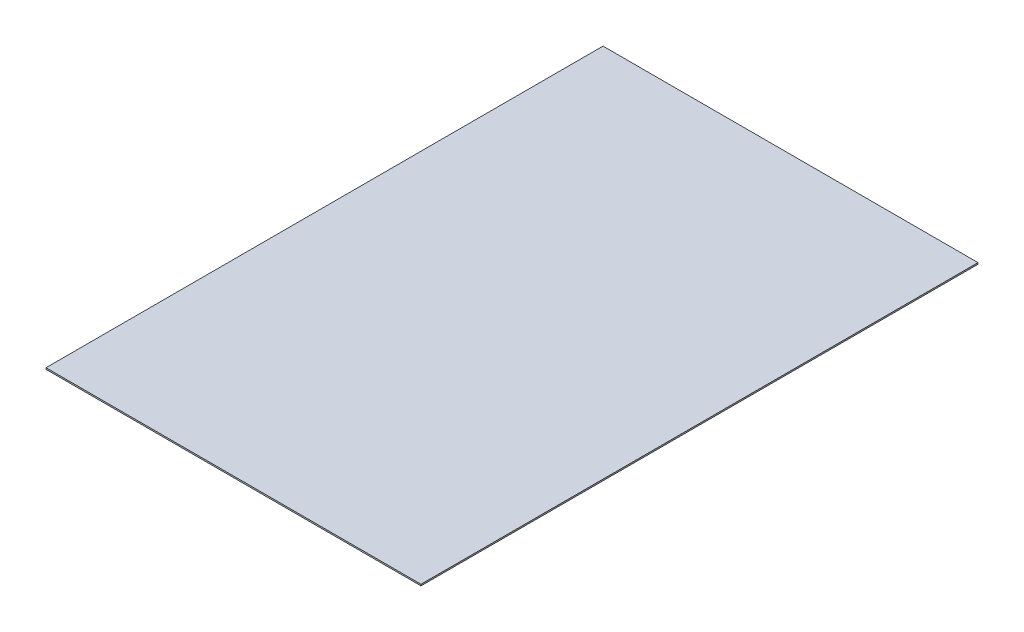
ISO-10303-21;
HEADER;
FILE_DESCRIPTION(('STEP AP214'),'2;1');
FILE_NAME('part.step','',(''),(''),'','','');
FILE_SCHEMA(('AUTOMOTIVE_DESIGN { 1 0 10303 214 1 1 1 1 }'));
ENDSEC;
DATA;
#1=APPLICATION_CONTEXT('core data for automotive mechanical design processes');
#2=APPLICATION_PROTOCOL_DEFINITION('international standard','automotive_design',2000,#1);
#3=PRODUCT_CONTEXT('',#1,'mechanical');
#4=PRODUCT('Part','Part','',(#3));
#5=PRODUCT_RELATED_PRODUCT_CATEGORY('part','',(#4));
#6=PRODUCT_DEFINITION_FORMATION('','',#4);
#7=PRODUCT_DEFINITION_CONTEXT('part definition',#1,'design');
#8=PRODUCT_DEFINITION('design','',#6,#7);
#9=PRODUCT_DEFINITION_SHAPE('','',#8);
#10=(LENGTH_UNIT() NAMED_UNIT(*) SI_UNIT(.MILLI.,.METRE.));
#11=(NAMED_UNIT(*) PLANE_ANGLE_UNIT() SI_UNIT($,.RADIAN.));
#12=(NAMED_UNIT(*) SI_UNIT($,.STERADIAN.) SOLID_ANGLE_UNIT());
#13=UNCERTAINTY_MEASURE_WITH_UNIT(LENGTH_MEASURE(1.E-05),#10,'distance_accuracy_value','');
#14=(GEOMETRIC_REPRESENTATION_CONTEXT(3) GLOBAL_UNCERTAINTY_ASSIGNED_CONTEXT((#13)) GLOBAL_UNIT_ASSIGNED_CONTEXT((#10,
#11,#12)) REPRESENTATION_CONTEXT('',''));
#15=CARTESIAN_POINT('',(0.,0.,0.));
#16=DIRECTION('',(0.,0.,1.));
#17=DIRECTION('',(1.,0.,0.));
#18=AXIS2_PLACEMENT_3D('',#15,#16,#17);
#19=CARTESIAN_POINT('',(-257.5,2.,382.5));
#20=DIRECTION('',(1.,0.,0.));
#21=DIRECTION('',(0.,0.,-1.));
#22=AXIS2_PLACEMENT_3D('',#19,#20,#21);
#23=PLANE('',#22);
#24=DIRECTION('',(0.,0.,1.));
#25=VECTOR('',#24,1.);
#26=CARTESIAN_POINT('',(-257.5,0.,382.5));
#27=LINE('',#26,#25);
#28=CARTESIAN_POINT('',(-257.5,0.,-382.5));
#29=VERTEX_POINT('',#28);
#30=CARTESIAN_POINT('',(-257.5,0.,382.5));
#31=VERTEX_POINT('',#30);
#32=EDGE_CURVE('E101',#29,#31,#27,.T.);
#33=ORIENTED_EDGE('',*,*,#32,.T.);
#34=DIRECTION('',(0.,-1.,0.));
#35=VECTOR('',#34,1.);
#36=CARTESIAN_POINT('',(-257.5,2.,382.5));
#37=LINE('',#36,#35);
#38=CARTESIAN_POINT('',(-257.5,2.,382.5));
#39=VERTEX_POINT('',#38);
#40=EDGE_CURVE('E11',#39,#31,#37,.T.);
#41=ORIENTED_EDGE('',*,*,#40,.F.);
#42=DIRECTION('',(0.,0.,1.));
#43=VECTOR('',#42,1.);
#44=CARTESIAN_POINT('',(-257.5,2.,382.5));
#45=LINE('',#44,#43);
#46=CARTESIAN_POINT('',(-257.5,2.,-382.5));
#47=VERTEX_POINT('',#46);
#48=EDGE_CURVE('E89',#47,#39,#45,.T.);
#49=ORIENTED_EDGE('',*,*,#48,.F.);
#50=DIRECTION('',(0.,-1.,0.));
#51=VECTOR('',#50,1.);
#52=CARTESIAN_POINT('',(-257.5,2.,-382.5));
#53=LINE('',#52,#51);
#54=EDGE_CURVE('E97',#47,#29,#53,.T.);
#55=ORIENTED_EDGE('',*,*,#54,.T.);
#56=EDGE_LOOP('',(#33,#41,#49,#55));
#57=FACE_BOUND('',#56,.T.);
#58=ADVANCED_FACE('F38',(#57),#23,.F.);
#59=CARTESIAN_POINT('',(257.5,2.,382.5));
#60=DIRECTION('',(0.,0.,-1.));
#61=DIRECTION('',(-1.,0.,0.));
#62=AXIS2_PLACEMENT_3D('',#59,#60,#61);
#63=PLANE('',#62);
#64=DIRECTION('',(1.,0.,0.));
#65=VECTOR('',#64,1.);
#66=CARTESIAN_POINT('',(257.5,0.,382.5));
#67=LINE('',#66,#65);
#68=CARTESIAN_POINT('',(257.5,0.,382.5));
#69=VERTEX_POINT('',#68);
#70=EDGE_CURVE('E93',#31,#69,#67,.T.);
#71=ORIENTED_EDGE('',*,*,#70,.T.);
#72=DIRECTION('',(0.,-1.,0.));
#73=VECTOR('',#72,1.);
#74=CARTESIAN_POINT('',(257.5,2.,382.5));
#75=LINE('',#74,#73);
#76=CARTESIAN_POINT('',(257.5,2.,382.5));
#77=VERTEX_POINT('',#76);
#78=EDGE_CURVE('E46',#77,#69,#75,.T.);
#79=ORIENTED_EDGE('',*,*,#78,.F.);
#80=DIRECTION('',(1.,0.,0.));
#81=VECTOR('',#80,1.);
#82=CARTESIAN_POINT('',(257.5,2.,382.5));
#83=LINE('',#82,#81);
#84=EDGE_CURVE('E84',#39,#77,#83,.T.);
#85=ORIENTED_EDGE('',*,*,#84,.F.);
#86=ORIENTED_EDGE('',*,*,#40,.T.);
#87=EDGE_LOOP('',(#71,#79,#85,#86));
#88=FACE_BOUND('',#87,.T.);
#89=ADVANCED_FACE('F92',(#88),#63,.F.);
#90=CARTESIAN_POINT('',(257.5,2.,382.5));
#91=DIRECTION('',(-1.,0.,0.));
#92=DIRECTION('',(0.,0.,1.));
#93=AXIS2_PLACEMENT_3D('',#90,#91,#92);
#94=PLANE('',#93);
#95=DIRECTION('',(0.,0.,-1.));
#96=VECTOR('',#95,1.);
#97=CARTESIAN_POINT('',(257.5,0.,382.5));
#98=LINE('',#97,#96);
#99=CARTESIAN_POINT('',(257.5,0.,-382.5));
#100=VERTEX_POINT('',#99);
#101=EDGE_CURVE('E71',#69,#100,#98,.T.);
#102=ORIENTED_EDGE('',*,*,#101,.T.);
#103=DIRECTION('',(0.,-1.,0.));
#104=VECTOR('',#103,1.);
#105=CARTESIAN_POINT('',(257.5,2.,-382.5));
#106=LINE('',#105,#104);
#107=CARTESIAN_POINT('',(257.5,2.,-382.5));
#108=VERTEX_POINT('',#107);
#109=EDGE_CURVE('E94',#108,#100,#106,.T.);
#110=ORIENTED_EDGE('',*,*,#109,.F.);
#111=DIRECTION('',(0.,0.,-1.));
#112=VECTOR('',#111,1.);
#113=CARTESIAN_POINT('',(257.5,2.,382.5));
#114=LINE('',#113,#112);
#115=EDGE_CURVE('E87',#77,#108,#114,.T.);
#116=ORIENTED_EDGE('',*,*,#115,.F.);
#117=ORIENTED_EDGE('',*,*,#78,.T.);
#118=EDGE_LOOP('',(#102,#110,#116,#117));
#119=FACE_BOUND('',#118,.T.);
#120=ADVANCED_FACE('F95',(#119),#94,.F.);
#121=CARTESIAN_POINT('',(257.5,2.,-382.5));
#122=DIRECTION('',(0.,0.,1.));
#123=DIRECTION('',(1.,0.,0.));
#124=AXIS2_PLACEMENT_3D('',#121,#122,#123);
#125=PLANE('',#124);
#126=DIRECTION('',(-1.,0.,0.));
#127=VECTOR('',#126,1.);
#128=CARTESIAN_POINT('',(257.5,0.,-382.5));
#129=LINE('',#128,#127);
#130=EDGE_CURVE('E77',#100,#29,#129,.T.);
#131=ORIENTED_EDGE('',*,*,#130,.T.);
#132=ORIENTED_EDGE('',*,*,#54,.F.);
#133=DIRECTION('',(-1.,0.,0.));
#134=VECTOR('',#133,1.);
#135=CARTESIAN_POINT('',(257.5,2.,-382.5));
#136=LINE('',#135,#134);
#137=EDGE_CURVE('E54',#108,#47,#136,.T.);
#138=ORIENTED_EDGE('',*,*,#137,.F.);
#139=ORIENTED_EDGE('',*,*,#109,.T.);
#140=EDGE_LOOP('',(#131,#132,#138,#139));
#141=FACE_BOUND('',#140,.T.);
#142=ADVANCED_FACE('F108',(#141),#125,.F.);
#143=CARTESIAN_POINT('',(0.,2.,0.));
#144=DIRECTION('',(0.,1.,0.));
#145=DIRECTION('',(0.,0.,1.));
#146=AXIS2_PLACEMENT_3D('',#143,#144,#145);
#147=PLANE('',#146);
#148=ORIENTED_EDGE('',*,*,#48,.T.);
#149=ORIENTED_EDGE('',*,*,#84,.T.);
#150=ORIENTED_EDGE('',*,*,#115,.T.);
#151=ORIENTED_EDGE('',*,*,#137,.T.);
#152=EDGE_LOOP('',(#148,#149,#150,#151));
#153=FACE_BOUND('',#152,.T.);
#154=ADVANCED_FACE('F85',(#153),#147,.T.);
#155=CARTESIAN_POINT('',(0.,0.,0.));
#156=DIRECTION('',(0.,1.,0.));
#157=DIRECTION('',(0.,0.,1.));
#158=AXIS2_PLACEMENT_3D('',#155,#156,#157);
#159=PLANE('',#158);
#160=ORIENTED_EDGE('',*,*,#32,.F.);
#161=ORIENTED_EDGE('',*,*,#130,.F.);
#162=ORIENTED_EDGE('',*,*,#101,.F.);
#163=ORIENTED_EDGE('',*,*,#70,.F.);
#164=EDGE_LOOP('',(#160,#161,#162,#163));
#165=FACE_BOUND('',#164,.T.);
#166=ADVANCED_FACE('F111',(#165),#159,.F.);
#167=CLOSED_SHELL('',(#58,#89,#120,#142,#154,#166));
#168=MANIFOLD_SOLID_BREP('B2',#167);
#169=ADVANCED_BREP_SHAPE_REPRESENTATION('',(#18,#168),#14);
#170=SHAPE_DEFINITION_REPRESENTATION(#9,#169);
ENDSEC;
END-ISO-10303-21;
